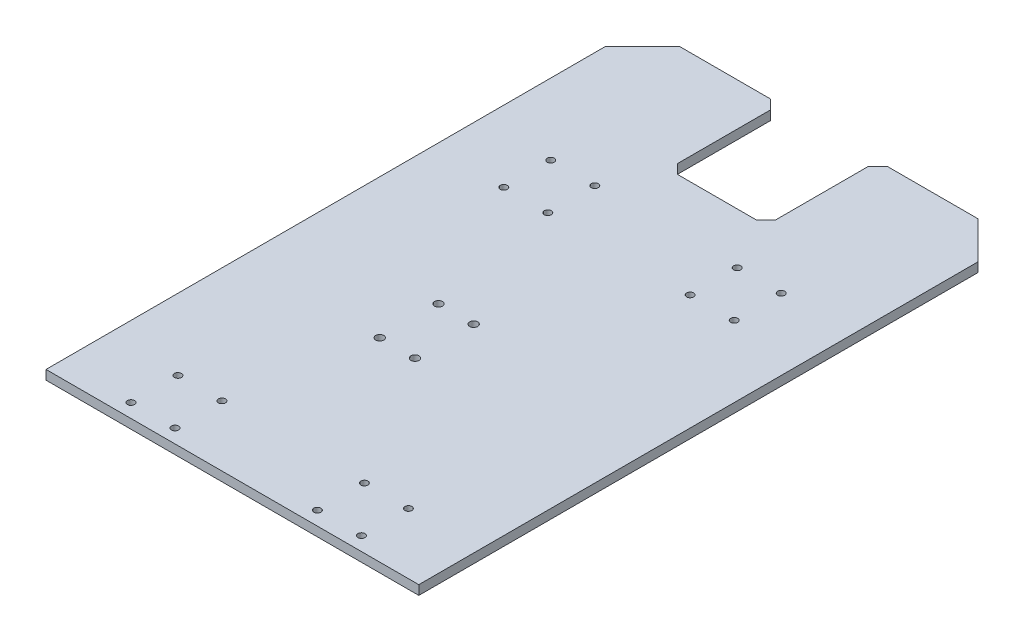
ISO-10303-21;
HEADER;
FILE_DESCRIPTION(('STEP AP214'),'2;1');
FILE_NAME('part.step','',(''),(''),'','','');
FILE_SCHEMA(('AUTOMOTIVE_DESIGN { 1 0 10303 214 1 1 1 1 }'));
ENDSEC;
DATA;
#1=APPLICATION_CONTEXT('core data for automotive mechanical design processes');
#2=APPLICATION_PROTOCOL_DEFINITION('international standard','automotive_design',2000,#1);
#3=PRODUCT_CONTEXT('',#1,'mechanical');
#4=PRODUCT('Part','Part','',(#3));
#5=PRODUCT_RELATED_PRODUCT_CATEGORY('part','',(#4));
#6=PRODUCT_DEFINITION_FORMATION('','',#4);
#7=PRODUCT_DEFINITION_CONTEXT('part definition',#1,'design');
#8=PRODUCT_DEFINITION('design','',#6,#7);
#9=PRODUCT_DEFINITION_SHAPE('','',#8);
#10=(LENGTH_UNIT() NAMED_UNIT(*) SI_UNIT(.MILLI.,.METRE.));
#11=(NAMED_UNIT(*) PLANE_ANGLE_UNIT() SI_UNIT($,.RADIAN.));
#12=(NAMED_UNIT(*) SI_UNIT($,.STERADIAN.) SOLID_ANGLE_UNIT());
#13=UNCERTAINTY_MEASURE_WITH_UNIT(LENGTH_MEASURE(1.E-05),#10,'distance_accuracy_value','');
#14=(GEOMETRIC_REPRESENTATION_CONTEXT(3) GLOBAL_UNCERTAINTY_ASSIGNED_CONTEXT((#13)) GLOBAL_UNIT_ASSIGNED_CONTEXT((#10,
#11,#12)) REPRESENTATION_CONTEXT('',''));
#15=CARTESIAN_POINT('',(0.,0.,0.));
#16=DIRECTION('',(0.,0.,1.));
#17=DIRECTION('',(1.,0.,0.));
#18=AXIS2_PLACEMENT_3D('',#15,#16,#17);
#19=CARTESIAN_POINT('',(0.,0.,-254.));
#20=DIRECTION('',(0.,0.,-1.));
#21=DIRECTION('',(-1.,0.,0.));
#22=AXIS2_PLACEMENT_3D('',#19,#20,#21);
#23=PLANE('',#22);
#24=DIRECTION('',(-1.,0.,0.));
#25=VECTOR('',#24,1.);
#26=CARTESIAN_POINT('',(127.,0.,-254.));
#27=LINE('',#26,#25);
#28=CARTESIAN_POINT('',(101.6,0.,-254.));
#29=VERTEX_POINT('',#28);
#30=CARTESIAN_POINT('',(39.6875,0.,-254.));
#31=VERTEX_POINT('',#30);
#32=EDGE_CURVE('E254',#29,#31,#27,.T.);
#33=ORIENTED_EDGE('',*,*,#32,.T.);
#34=DIRECTION('',(0.,1.,0.));
#35=VECTOR('',#34,1.);
#36=CARTESIAN_POINT('',(39.6875,6.35,-254.));
#37=LINE('',#36,#35);
#38=CARTESIAN_POINT('',(39.6875,6.35,-254.));
#39=VERTEX_POINT('',#38);
#40=EDGE_CURVE('E210',#31,#39,#37,.T.);
#41=ORIENTED_EDGE('',*,*,#40,.T.);
#42=DIRECTION('',(1.,0.,0.));
#43=VECTOR('',#42,1.);
#44=CARTESIAN_POINT('',(-127.,6.35,-254.));
#45=LINE('',#44,#43);
#46=CARTESIAN_POINT('',(101.6,6.35,-254.));
#47=VERTEX_POINT('',#46);
#48=EDGE_CURVE('E265',#39,#47,#45,.T.);
#49=ORIENTED_EDGE('',*,*,#48,.T.);
#50=DIRECTION('',(0.,-1.,0.));
#51=VECTOR('',#50,1.);
#52=CARTESIAN_POINT('',(101.6,0.,-254.));
#53=LINE('',#52,#51);
#54=EDGE_CURVE('E160',#47,#29,#53,.T.);
#55=ORIENTED_EDGE('',*,*,#54,.T.);
#56=EDGE_LOOP('',(#33,#41,#49,#55));
#57=FACE_BOUND('',#56,.T.);
#58=ADVANCED_FACE('F39',(#57),#23,.T.);
#59=CARTESIAN_POINT('',(127.,6.35,-152.4));
#60=DIRECTION('',(-1.,0.,0.));
#61=DIRECTION('',(0.,0.,1.));
#62=AXIS2_PLACEMENT_3D('',#59,#60,#61);
#63=PLANE('',#62);
#64=DIRECTION('',(0.,0.,-1.));
#65=VECTOR('',#64,1.);
#66=CARTESIAN_POINT('',(127.,0.,-152.4));
#67=LINE('',#66,#65);
#68=CARTESIAN_POINT('',(127.,0.,152.4));
#69=VERTEX_POINT('',#68);
#70=CARTESIAN_POINT('',(127.,0.,-228.6));
#71=VERTEX_POINT('',#70);
#72=EDGE_CURVE('E170',#69,#71,#67,.T.);
#73=ORIENTED_EDGE('',*,*,#72,.T.);
#74=DIRECTION('',(0.,1.,0.));
#75=VECTOR('',#74,1.);
#76=CARTESIAN_POINT('',(127.,6.35,-228.6));
#77=LINE('',#76,#75);
#78=CARTESIAN_POINT('',(127.,6.35,-228.6));
#79=VERTEX_POINT('',#78);
#80=EDGE_CURVE('E193',#71,#79,#77,.T.);
#81=ORIENTED_EDGE('',*,*,#80,.T.);
#82=DIRECTION('',(0.,0.,-1.));
#83=VECTOR('',#82,1.);
#84=CARTESIAN_POINT('',(127.,6.35,-152.4));
#85=LINE('',#84,#83);
#86=CARTESIAN_POINT('',(127.,6.35,152.4));
#87=VERTEX_POINT('',#86);
#88=EDGE_CURVE('E151',#87,#79,#85,.T.);
#89=ORIENTED_EDGE('',*,*,#88,.F.);
#90=DIRECTION('',(0.,-1.,0.));
#91=VECTOR('',#90,1.);
#92=CARTESIAN_POINT('',(127.,6.35,152.4));
#93=LINE('',#92,#91);
#94=EDGE_CURVE('E161',#87,#69,#93,.T.);
#95=ORIENTED_EDGE('',*,*,#94,.T.);
#96=EDGE_LOOP('',(#73,#81,#89,#95));
#97=FACE_BOUND('',#96,.T.);
#98=ADVANCED_FACE('F394',(#97),#63,.F.);
#99=CARTESIAN_POINT('',(-127.,6.35,-152.4));
#100=DIRECTION('',(1.,0.,0.));
#101=DIRECTION('',(0.,0.,-1.));
#102=AXIS2_PLACEMENT_3D('',#99,#100,#101);
#103=PLANE('',#102);
#104=DIRECTION('',(0.,0.,1.));
#105=VECTOR('',#104,1.);
#106=CARTESIAN_POINT('',(-127.,6.35,-152.4));
#107=LINE('',#106,#105);
#108=CARTESIAN_POINT('',(-127.,6.35,-228.6));
#109=VERTEX_POINT('',#108);
#110=CARTESIAN_POINT('',(-127.,6.35,152.4));
#111=VERTEX_POINT('',#110);
#112=EDGE_CURVE('E139',#109,#111,#107,.T.);
#113=ORIENTED_EDGE('',*,*,#112,.F.);
#114=DIRECTION('',(0.,-1.,0.));
#115=VECTOR('',#114,1.);
#116=CARTESIAN_POINT('',(-127.,0.,-228.6));
#117=LINE('',#116,#115);
#118=CARTESIAN_POINT('',(-127.,0.,-228.6));
#119=VERTEX_POINT('',#118);
#120=EDGE_CURVE('E186',#109,#119,#117,.T.);
#121=ORIENTED_EDGE('',*,*,#120,.T.);
#122=DIRECTION('',(0.,0.,1.));
#123=VECTOR('',#122,1.);
#124=CARTESIAN_POINT('',(-127.,0.,-152.4));
#125=LINE('',#124,#123);
#126=CARTESIAN_POINT('',(-127.,0.,152.4));
#127=VERTEX_POINT('',#126);
#128=EDGE_CURVE('E157',#119,#127,#125,.T.);
#129=ORIENTED_EDGE('',*,*,#128,.T.);
#130=DIRECTION('',(0.,-1.,0.));
#131=VECTOR('',#130,1.);
#132=CARTESIAN_POINT('',(-127.,6.35,152.4));
#133=LINE('',#132,#131);
#134=EDGE_CURVE('E154',#111,#127,#133,.T.);
#135=ORIENTED_EDGE('',*,*,#134,.F.);
#136=EDGE_LOOP('',(#113,#121,#129,#135));
#137=FACE_BOUND('',#136,.T.);
#138=ADVANCED_FACE('F155',(#137),#103,.F.);
#139=CARTESIAN_POINT('',(-127.,6.35,152.4));
#140=DIRECTION('',(0.,0.,-1.));
#141=DIRECTION('',(-1.,0.,0.));
#142=AXIS2_PLACEMENT_3D('',#139,#140,#141);
#143=PLANE('',#142);
#144=DIRECTION('',(1.,0.,0.));
#145=VECTOR('',#144,1.);
#146=CARTESIAN_POINT('',(-127.,0.,152.4));
#147=LINE('',#146,#145);
#148=EDGE_CURVE('E175',#127,#69,#147,.T.);
#149=ORIENTED_EDGE('',*,*,#148,.T.);
#150=ORIENTED_EDGE('',*,*,#94,.F.);
#151=DIRECTION('',(1.,0.,0.));
#152=VECTOR('',#151,1.);
#153=CARTESIAN_POINT('',(-127.,6.35,152.4));
#154=LINE('',#153,#152);
#155=EDGE_CURVE('E146',#111,#87,#154,.T.);
#156=ORIENTED_EDGE('',*,*,#155,.F.);
#157=ORIENTED_EDGE('',*,*,#134,.T.);
#158=EDGE_LOOP('',(#149,#150,#156,#157));
#159=FACE_BOUND('',#158,.T.);
#160=ADVANCED_FACE('F163',(#159),#143,.F.);
#161=CARTESIAN_POINT('',(0.,6.35,0.));
#162=DIRECTION('',(0.,1.,0.));
#163=DIRECTION('',(0.,0.,1.));
#164=AXIS2_PLACEMENT_3D('',#161,#162,#163);
#165=PLANE('',#164);
#166=CARTESIAN_POINT('',(-8.00000000000002,6.35,-19.9999999739992));
#167=DIRECTION('',(0.,1.,0.));
#168=DIRECTION('',(0.,0.,1.));
#169=AXIS2_PLACEMENT_3D('',#166,#167,#168);
#170=CIRCLE('',#169,2.74999999999999);
#171=CARTESIAN_POINT('',(-8.00000000000002,6.35,-17.2499999739993));
#172=VERTEX_POINT('',#171);
#173=EDGE_CURVE('E728',#172,#172,#170,.T.);
#174=ORIENTED_EDGE('',*,*,#173,.F.);
#175=EDGE_LOOP('',(#174));
#176=FACE_BOUND('',#175,.T.);
#177=CARTESIAN_POINT('',(-32.,6.35,-19.9999999739992));
#178=DIRECTION('',(0.,1.,0.));
#179=DIRECTION('',(0.,0.,1.));
#180=AXIS2_PLACEMENT_3D('',#177,#178,#179);
#181=CIRCLE('',#180,2.74999999999999);
#182=CARTESIAN_POINT('',(-32.,6.35,-17.2499999739993));
#183=VERTEX_POINT('',#182);
#184=EDGE_CURVE('E730',#183,#183,#181,.T.);
#185=ORIENTED_EDGE('',*,*,#184,.F.);
#186=EDGE_LOOP('',(#185));
#187=FACE_BOUND('',#186,.T.);
#188=CARTESIAN_POINT('',(-32.,6.35,20.0000000260008));
#189=DIRECTION('',(0.,1.,0.));
#190=DIRECTION('',(0.,0.,1.));
#191=AXIS2_PLACEMENT_3D('',#188,#189,#190);
#192=CIRCLE('',#191,2.74999999999999);
#193=CARTESIAN_POINT('',(-32.,6.35,22.7500000260008));
#194=VERTEX_POINT('',#193);
#195=EDGE_CURVE('E738',#194,#194,#192,.T.);
#196=ORIENTED_EDGE('',*,*,#195,.F.);
#197=EDGE_LOOP('',(#196));
#198=FACE_BOUND('',#197,.T.);
#199=CARTESIAN_POINT('',(-8.00000000000002,6.35,20.0000000260008));
#200=DIRECTION('',(0.,1.,0.));
#201=DIRECTION('',(0.,0.,1.));
#202=AXIS2_PLACEMENT_3D('',#199,#200,#201);
#203=CIRCLE('',#202,2.74999999999999);
#204=CARTESIAN_POINT('',(-8.00000000000002,6.35,22.7500000260007));
#205=VERTEX_POINT('',#204);
#206=EDGE_CURVE('E744',#205,#205,#203,.T.);
#207=ORIENTED_EDGE('',*,*,#206,.F.);
#208=EDGE_LOOP('',(#207));
#209=FACE_BOUND('',#208,.T.);
#210=ORIENTED_EDGE('',*,*,#48,.F.);
#211=DIRECTION('',(-0.707106781186546,0.,0.707106781186549));
#212=VECTOR('',#211,1.);
#213=CARTESIAN_POINT('',(-107.15625,6.35,-107.156249999999));
#214=LINE('',#213,#212);
#215=CARTESIAN_POINT('',(33.3375,6.35,-247.65));
#216=VERTEX_POINT('',#215);
#217=EDGE_CURVE('E214',#39,#216,#214,.T.);
#218=ORIENTED_EDGE('',*,*,#217,.T.);
#219=DIRECTION('',(0.,0.,-1.));
#220=VECTOR('',#219,1.);
#221=CARTESIAN_POINT('',(33.3375,6.35,-254.));
#222=LINE('',#221,#220);
#223=CARTESIAN_POINT('',(33.3375,6.35,-184.15));
#224=VERTEX_POINT('',#223);
#225=EDGE_CURVE('E237',#224,#216,#222,.T.);
#226=ORIENTED_EDGE('',*,*,#225,.F.);
#227=DIRECTION('',(0.707106781186541,0.,-0.707106781186554));
#228=VECTOR('',#227,1.);
#229=CARTESIAN_POINT('',(33.3375,6.35,-184.15));
#230=LINE('',#229,#228);
#231=CARTESIAN_POINT('',(26.9875,6.35,-177.8));
#232=VERTEX_POINT('',#231);
#233=EDGE_CURVE('E221',#224,#232,#230,.F.);
#234=ORIENTED_EDGE('',*,*,#233,.T.);
#235=DIRECTION('',(1.,0.,0.));
#236=VECTOR('',#235,1.);
#237=CARTESIAN_POINT('',(-33.3375,6.35,-177.8));
#238=LINE('',#237,#236);
#239=CARTESIAN_POINT('',(-26.9874999999999,6.35,-177.8));
#240=VERTEX_POINT('',#239);
#241=EDGE_CURVE('E228',#240,#232,#238,.T.);
#242=ORIENTED_EDGE('',*,*,#241,.F.);
#243=DIRECTION('',(0.707106781186551,0.,0.707106781186544));
#244=VECTOR('',#243,1.);
#245=CARTESIAN_POINT('',(-26.9874999999999,6.35,-177.8));
#246=LINE('',#245,#244);
#247=CARTESIAN_POINT('',(-33.3375,6.35,-184.15));
#248=VERTEX_POINT('',#247);
#249=EDGE_CURVE('E48',#240,#248,#246,.F.);
#250=ORIENTED_EDGE('',*,*,#249,.T.);
#251=DIRECTION('',(0.,0.,1.));
#252=VECTOR('',#251,1.);
#253=CARTESIAN_POINT('',(-33.3375,6.35,-254.));
#254=LINE('',#253,#252);
#255=CARTESIAN_POINT('',(-33.3375,6.35,-247.65));
#256=VERTEX_POINT('',#255);
#257=EDGE_CURVE('E226',#256,#248,#254,.T.);
#258=ORIENTED_EDGE('',*,*,#257,.F.);
#259=DIRECTION('',(-0.707106781186548,0.,-0.707106781186548));
#260=VECTOR('',#259,1.);
#261=CARTESIAN_POINT('',(107.15625,6.35,-107.15625));
#262=LINE('',#261,#260);
#263=CARTESIAN_POINT('',(-39.6875,6.35,-254.));
#264=VERTEX_POINT('',#263);
#265=EDGE_CURVE('E63',#256,#264,#262,.T.);
#266=ORIENTED_EDGE('',*,*,#265,.T.);
#267=CARTESIAN_POINT('',(-101.6,6.35,-254.));
#268=VERTEX_POINT('',#267);
#269=EDGE_CURVE('E266',#268,#264,#45,.T.);
#270=ORIENTED_EDGE('',*,*,#269,.F.);
#271=DIRECTION('',(-0.707106781186546,0.,0.707106781186549));
#272=VECTOR('',#271,1.);
#273=CARTESIAN_POINT('',(-177.8,6.35,-177.8));
#274=LINE('',#273,#272);
#275=EDGE_CURVE('E148',#268,#109,#274,.T.);
#276=ORIENTED_EDGE('',*,*,#275,.T.);
#277=ORIENTED_EDGE('',*,*,#112,.T.);
#278=ORIENTED_EDGE('',*,*,#155,.T.);
#279=ORIENTED_EDGE('',*,*,#88,.T.);
#280=DIRECTION('',(-0.707106781186546,0.,-0.707106781186549));
#281=VECTOR('',#280,1.);
#282=CARTESIAN_POINT('',(177.8,6.35,-177.8));
#283=LINE('',#282,#281);
#284=EDGE_CURVE('E182',#79,#47,#283,.T.);
#285=ORIENTED_EDGE('',*,*,#284,.T.);
#286=EDGE_LOOP('',(#210,#218,#226,#234,#242,#250,#258,#266,#270,#276,#277,#278,#279,#285));
#287=FACE_BOUND('',#286,.T.);
#288=CARTESIAN_POINT('',(78.5000000000001,6.35,111.));
#289=DIRECTION('',(0.,1.,0.));
#290=DIRECTION('',(0.,0.,1.));
#291=AXIS2_PLACEMENT_3D('',#288,#289,#290);
#292=CIRCLE('',#291,2.4);
#293=CARTESIAN_POINT('',(78.5000000000001,6.35,113.4));
#294=VERTEX_POINT('',#293);
#295=EDGE_CURVE('E268',#294,#294,#292,.T.);
#296=ORIENTED_EDGE('',*,*,#295,.F.);
#297=EDGE_LOOP('',(#296));
#298=FACE_BOUND('',#297,.T.);
#299=CARTESIAN_POINT('',(48.5000000000001,6.35,111.));
#300=DIRECTION('',(0.,1.,0.));
#301=DIRECTION('',(0.,0.,1.));
#302=AXIS2_PLACEMENT_3D('',#299,#300,#301);
#303=CIRCLE('',#302,2.4);
#304=CARTESIAN_POINT('',(48.5000000000001,6.35,113.4));
#305=VERTEX_POINT('',#304);
#306=EDGE_CURVE('E274',#305,#305,#303,.T.);
#307=ORIENTED_EDGE('',*,*,#306,.F.);
#308=EDGE_LOOP('',(#307));
#309=FACE_BOUND('',#308,.T.);
#310=CARTESIAN_POINT('',(48.5000000000001,6.35,143.));
#311=DIRECTION('',(0.,1.,0.));
#312=DIRECTION('',(0.,0.,1.));
#313=AXIS2_PLACEMENT_3D('',#310,#311,#312);
#314=CIRCLE('',#313,2.4);
#315=CARTESIAN_POINT('',(48.5000000000001,6.35,145.4));
#316=VERTEX_POINT('',#315);
#317=EDGE_CURVE('E280',#316,#316,#314,.T.);
#318=ORIENTED_EDGE('',*,*,#317,.F.);
#319=EDGE_LOOP('',(#318));
#320=FACE_BOUND('',#319,.T.);
#321=CARTESIAN_POINT('',(78.5000000000001,6.35,143.));
#322=DIRECTION('',(0.,1.,0.));
#323=DIRECTION('',(0.,0.,1.));
#324=AXIS2_PLACEMENT_3D('',#321,#322,#323);
#325=CIRCLE('',#324,2.4);
#326=CARTESIAN_POINT('',(78.5000000000001,6.35,145.4));
#327=VERTEX_POINT('',#326);
#328=EDGE_CURVE('E286',#327,#327,#325,.T.);
#329=ORIENTED_EDGE('',*,*,#328,.F.);
#330=EDGE_LOOP('',(#329));
#331=FACE_BOUND('',#330,.T.);
#332=CARTESIAN_POINT('',(-48.4999999999999,6.35,111.));
#333=DIRECTION('',(0.,1.,0.));
#334=DIRECTION('',(0.,0.,1.));
#335=AXIS2_PLACEMENT_3D('',#332,#333,#334);
#336=CIRCLE('',#335,2.4);
#337=CARTESIAN_POINT('',(-48.4999999999999,6.35,113.4));
#338=VERTEX_POINT('',#337);
#339=EDGE_CURVE('E292',#338,#338,#336,.T.);
#340=ORIENTED_EDGE('',*,*,#339,.F.);
#341=EDGE_LOOP('',(#340));
#342=FACE_BOUND('',#341,.T.);
#343=CARTESIAN_POINT('',(-48.4999999999999,6.35,143.));
#344=DIRECTION('',(0.,1.,0.));
#345=DIRECTION('',(0.,0.,1.));
#346=AXIS2_PLACEMENT_3D('',#343,#344,#345);
#347=CIRCLE('',#346,2.4);
#348=CARTESIAN_POINT('',(-48.4999999999999,6.35,145.4));
#349=VERTEX_POINT('',#348);
#350=EDGE_CURVE('E298',#349,#349,#347,.T.);
#351=ORIENTED_EDGE('',*,*,#350,.F.);
#352=EDGE_LOOP('',(#351));
#353=FACE_BOUND('',#352,.T.);
#354=CARTESIAN_POINT('',(-78.4999999999999,6.35,111.));
#355=DIRECTION('',(0.,1.,0.));
#356=DIRECTION('',(0.,0.,1.));
#357=AXIS2_PLACEMENT_3D('',#354,#355,#356);
#358=CIRCLE('',#357,2.4);
#359=CARTESIAN_POINT('',(-78.4999999999999,6.35,113.4));
#360=VERTEX_POINT('',#359);
#361=EDGE_CURVE('E304',#360,#360,#358,.T.);
#362=ORIENTED_EDGE('',*,*,#361,.F.);
#363=EDGE_LOOP('',(#362));
#364=FACE_BOUND('',#363,.T.);
#365=CARTESIAN_POINT('',(-78.4999999999999,6.35,143.));
#366=DIRECTION('',(0.,1.,0.));
#367=DIRECTION('',(0.,0.,1.));
#368=AXIS2_PLACEMENT_3D('',#365,#366,#367);
#369=CIRCLE('',#368,2.4);
#370=CARTESIAN_POINT('',(-78.4999999999999,6.35,145.4));
#371=VERTEX_POINT('',#370);
#372=EDGE_CURVE('E310',#371,#371,#369,.T.);
#373=ORIENTED_EDGE('',*,*,#372,.F.);
#374=EDGE_LOOP('',(#373));
#375=FACE_BOUND('',#374,.T.);
#376=CARTESIAN_POINT('',(78.5,6.35,-143.));
#377=DIRECTION('',(0.,1.,0.));
#378=DIRECTION('',(0.,0.,1.));
#379=AXIS2_PLACEMENT_3D('',#376,#377,#378);
#380=CIRCLE('',#379,2.4);
#381=CARTESIAN_POINT('',(78.5,6.35,-140.6));
#382=VERTEX_POINT('',#381);
#383=EDGE_CURVE('E316',#382,#382,#380,.T.);
#384=ORIENTED_EDGE('',*,*,#383,.F.);
#385=EDGE_LOOP('',(#384));
#386=FACE_BOUND('',#385,.T.);
#387=CARTESIAN_POINT('',(78.5,6.35,-111.));
#388=DIRECTION('',(0.,1.,0.));
#389=DIRECTION('',(0.,0.,1.));
#390=AXIS2_PLACEMENT_3D('',#387,#388,#389);
#391=CIRCLE('',#390,2.4);
#392=CARTESIAN_POINT('',(78.5,6.35,-108.6));
#393=VERTEX_POINT('',#392);
#394=EDGE_CURVE('E322',#393,#393,#391,.T.);
#395=ORIENTED_EDGE('',*,*,#394,.F.);
#396=EDGE_LOOP('',(#395));
#397=FACE_BOUND('',#396,.T.);
#398=CARTESIAN_POINT('',(48.5,6.35,-143.));
#399=DIRECTION('',(0.,1.,0.));
#400=DIRECTION('',(0.,0.,1.));
#401=AXIS2_PLACEMENT_3D('',#398,#399,#400);
#402=CIRCLE('',#401,2.4);
#403=CARTESIAN_POINT('',(48.5,6.35,-140.6));
#404=VERTEX_POINT('',#403);
#405=EDGE_CURVE('E328',#404,#404,#402,.T.);
#406=ORIENTED_EDGE('',*,*,#405,.F.);
#407=EDGE_LOOP('',(#406));
#408=FACE_BOUND('',#407,.T.);
#409=CARTESIAN_POINT('',(48.5,6.35,-111.));
#410=DIRECTION('',(0.,1.,0.));
#411=DIRECTION('',(0.,0.,1.));
#412=AXIS2_PLACEMENT_3D('',#409,#410,#411);
#413=CIRCLE('',#412,2.4);
#414=CARTESIAN_POINT('',(48.5,6.35,-108.6));
#415=VERTEX_POINT('',#414);
#416=EDGE_CURVE('E334',#415,#415,#413,.T.);
#417=ORIENTED_EDGE('',*,*,#416,.F.);
#418=EDGE_LOOP('',(#417));
#419=FACE_BOUND('',#418,.T.);
#420=CARTESIAN_POINT('',(-48.5,6.35,-143.));
#421=DIRECTION('',(0.,1.,0.));
#422=DIRECTION('',(0.,0.,1.));
#423=AXIS2_PLACEMENT_3D('',#420,#421,#422);
#424=CIRCLE('',#423,2.4);
#425=CARTESIAN_POINT('',(-48.5,6.35,-140.6));
#426=VERTEX_POINT('',#425);
#427=EDGE_CURVE('E340',#426,#426,#424,.T.);
#428=ORIENTED_EDGE('',*,*,#427,.F.);
#429=EDGE_LOOP('',(#428));
#430=FACE_BOUND('',#429,.T.);
#431=CARTESIAN_POINT('',(-48.4999999999999,6.35,-111.));
#432=DIRECTION('',(0.,1.,0.));
#433=DIRECTION('',(0.,0.,1.));
#434=AXIS2_PLACEMENT_3D('',#431,#432,#433);
#435=CIRCLE('',#434,2.4);
#436=CARTESIAN_POINT('',(-48.4999999999999,6.35,-108.6));
#437=VERTEX_POINT('',#436);
#438=EDGE_CURVE('E346',#437,#437,#435,.T.);
#439=ORIENTED_EDGE('',*,*,#438,.F.);
#440=EDGE_LOOP('',(#439));
#441=FACE_BOUND('',#440,.T.);
#442=CARTESIAN_POINT('',(-78.4999999999999,6.35,-143.));
#443=DIRECTION('',(0.,1.,0.));
#444=DIRECTION('',(0.,0.,1.));
#445=AXIS2_PLACEMENT_3D('',#442,#443,#444);
#446=CIRCLE('',#445,2.4);
#447=CARTESIAN_POINT('',(-78.4999999999999,6.35,-140.6));
#448=VERTEX_POINT('',#447);
#449=EDGE_CURVE('E352',#448,#448,#446,.T.);
#450=ORIENTED_EDGE('',*,*,#449,.F.);
#451=EDGE_LOOP('',(#450));
#452=FACE_BOUND('',#451,.T.);
#453=CARTESIAN_POINT('',(-78.4999999999999,6.35,-111.));
#454=DIRECTION('',(0.,1.,0.));
#455=DIRECTION('',(0.,0.,1.));
#456=AXIS2_PLACEMENT_3D('',#453,#454,#455);
#457=CIRCLE('',#456,2.4);
#458=CARTESIAN_POINT('',(-78.4999999999999,6.35,-108.6));
#459=VERTEX_POINT('',#458);
#460=EDGE_CURVE('E358',#459,#459,#457,.T.);
#461=ORIENTED_EDGE('',*,*,#460,.F.);
#462=EDGE_LOOP('',(#461));
#463=FACE_BOUND('',#462,.T.);
#464=ADVANCED_FACE('F142',(#176,#187,#198,#209,#287,#298,#309,#320,#331,#342,#353,#364,#375,
#386,#397,#408,#419,#430,#441,#452,#463),#165,.T.);
#465=CARTESIAN_POINT('',(0.,0.,0.));
#466=DIRECTION('',(0.,1.,0.));
#467=DIRECTION('',(0.,0.,1.));
#468=AXIS2_PLACEMENT_3D('',#465,#466,#467);
#469=PLANE('',#468);
#470=CARTESIAN_POINT('',(-8.00000000000002,0.,-19.9999999739992));
#471=DIRECTION('',(0.,1.,0.));
#472=DIRECTION('',(0.,0.,1.));
#473=AXIS2_PLACEMENT_3D('',#470,#471,#472);
#474=CIRCLE('',#473,2.74999999999999);
#475=CARTESIAN_POINT('',(-8.00000000000002,0.,-17.2499999739993));
#476=VERTEX_POINT('',#475);
#477=EDGE_CURVE('E725',#476,#476,#474,.T.);
#478=ORIENTED_EDGE('',*,*,#477,.T.);
#479=EDGE_LOOP('',(#478));
#480=FACE_BOUND('',#479,.T.);
#481=CARTESIAN_POINT('',(-32.,0.,-19.9999999739992));
#482=DIRECTION('',(0.,1.,0.));
#483=DIRECTION('',(0.,0.,1.));
#484=AXIS2_PLACEMENT_3D('',#481,#482,#483);
#485=CIRCLE('',#484,2.74999999999999);
#486=CARTESIAN_POINT('',(-32.,0.,-17.2499999739993));
#487=VERTEX_POINT('',#486);
#488=EDGE_CURVE('E735',#487,#487,#485,.T.);
#489=ORIENTED_EDGE('',*,*,#488,.T.);
#490=EDGE_LOOP('',(#489));
#491=FACE_BOUND('',#490,.T.);
#492=CARTESIAN_POINT('',(-32.,0.,20.0000000260008));
#493=DIRECTION('',(0.,1.,0.));
#494=DIRECTION('',(0.,0.,1.));
#495=AXIS2_PLACEMENT_3D('',#492,#493,#494);
#496=CIRCLE('',#495,2.74999999999999);
#497=CARTESIAN_POINT('',(-32.,0.,22.7500000260008));
#498=VERTEX_POINT('',#497);
#499=EDGE_CURVE('E741',#498,#498,#496,.T.);
#500=ORIENTED_EDGE('',*,*,#499,.T.);
#501=EDGE_LOOP('',(#500));
#502=FACE_BOUND('',#501,.T.);
#503=CARTESIAN_POINT('',(-8.00000000000002,0.,20.0000000260008));
#504=DIRECTION('',(0.,1.,0.));
#505=DIRECTION('',(0.,0.,1.));
#506=AXIS2_PLACEMENT_3D('',#503,#504,#505);
#507=CIRCLE('',#506,2.74999999999999);
#508=CARTESIAN_POINT('',(-8.00000000000002,0.,22.7500000260007));
#509=VERTEX_POINT('',#508);
#510=EDGE_CURVE('E261',#509,#509,#507,.T.);
#511=ORIENTED_EDGE('',*,*,#510,.T.);
#512=EDGE_LOOP('',(#511));
#513=FACE_BOUND('',#512,.T.);
#514=CARTESIAN_POINT('',(78.5000000000001,0.,111.));
#515=DIRECTION('',(0.,1.,0.));
#516=DIRECTION('',(0.,0.,1.));
#517=AXIS2_PLACEMENT_3D('',#514,#515,#516);
#518=CIRCLE('',#517,2.4);
#519=CARTESIAN_POINT('',(78.5000000000001,0.,113.4));
#520=VERTEX_POINT('',#519);
#521=EDGE_CURVE('E271',#520,#520,#518,.T.);
#522=ORIENTED_EDGE('',*,*,#521,.T.);
#523=EDGE_LOOP('',(#522));
#524=FACE_BOUND('',#523,.T.);
#525=CARTESIAN_POINT('',(48.5000000000001,0.,111.));
#526=DIRECTION('',(0.,1.,0.));
#527=DIRECTION('',(0.,0.,1.));
#528=AXIS2_PLACEMENT_3D('',#525,#526,#527);
#529=CIRCLE('',#528,2.4);
#530=CARTESIAN_POINT('',(48.5000000000001,0.,113.4));
#531=VERTEX_POINT('',#530);
#532=EDGE_CURVE('E277',#531,#531,#529,.T.);
#533=ORIENTED_EDGE('',*,*,#532,.T.);
#534=EDGE_LOOP('',(#533));
#535=FACE_BOUND('',#534,.T.);
#536=CARTESIAN_POINT('',(48.5000000000001,0.,143.));
#537=DIRECTION('',(0.,1.,0.));
#538=DIRECTION('',(0.,0.,1.));
#539=AXIS2_PLACEMENT_3D('',#536,#537,#538);
#540=CIRCLE('',#539,2.4);
#541=CARTESIAN_POINT('',(48.5000000000001,0.,145.4));
#542=VERTEX_POINT('',#541);
#543=EDGE_CURVE('E283',#542,#542,#540,.T.);
#544=ORIENTED_EDGE('',*,*,#543,.T.);
#545=EDGE_LOOP('',(#544));
#546=FACE_BOUND('',#545,.T.);
#547=CARTESIAN_POINT('',(78.5000000000001,0.,143.));
#548=DIRECTION('',(0.,1.,0.));
#549=DIRECTION('',(0.,0.,1.));
#550=AXIS2_PLACEMENT_3D('',#547,#548,#549);
#551=CIRCLE('',#550,2.4);
#552=CARTESIAN_POINT('',(78.5000000000001,0.,145.4));
#553=VERTEX_POINT('',#552);
#554=EDGE_CURVE('E289',#553,#553,#551,.T.);
#555=ORIENTED_EDGE('',*,*,#554,.T.);
#556=EDGE_LOOP('',(#555));
#557=FACE_BOUND('',#556,.T.);
#558=CARTESIAN_POINT('',(-48.4999999999999,0.,111.));
#559=DIRECTION('',(0.,1.,0.));
#560=DIRECTION('',(0.,0.,1.));
#561=AXIS2_PLACEMENT_3D('',#558,#559,#560);
#562=CIRCLE('',#561,2.4);
#563=CARTESIAN_POINT('',(-48.4999999999999,0.,113.4));
#564=VERTEX_POINT('',#563);
#565=EDGE_CURVE('E295',#564,#564,#562,.T.);
#566=ORIENTED_EDGE('',*,*,#565,.T.);
#567=EDGE_LOOP('',(#566));
#568=FACE_BOUND('',#567,.T.);
#569=CARTESIAN_POINT('',(-48.4999999999999,0.,143.));
#570=DIRECTION('',(0.,1.,0.));
#571=DIRECTION('',(0.,0.,1.));
#572=AXIS2_PLACEMENT_3D('',#569,#570,#571);
#573=CIRCLE('',#572,2.4);
#574=CARTESIAN_POINT('',(-48.4999999999999,0.,145.4));
#575=VERTEX_POINT('',#574);
#576=EDGE_CURVE('E301',#575,#575,#573,.T.);
#577=ORIENTED_EDGE('',*,*,#576,.T.);
#578=EDGE_LOOP('',(#577));
#579=FACE_BOUND('',#578,.T.);
#580=CARTESIAN_POINT('',(-78.4999999999999,0.,111.));
#581=DIRECTION('',(0.,1.,0.));
#582=DIRECTION('',(0.,0.,1.));
#583=AXIS2_PLACEMENT_3D('',#580,#581,#582);
#584=CIRCLE('',#583,2.4);
#585=CARTESIAN_POINT('',(-78.4999999999999,0.,113.4));
#586=VERTEX_POINT('',#585);
#587=EDGE_CURVE('E307',#586,#586,#584,.T.);
#588=ORIENTED_EDGE('',*,*,#587,.T.);
#589=EDGE_LOOP('',(#588));
#590=FACE_BOUND('',#589,.T.);
#591=CARTESIAN_POINT('',(-78.4999999999999,0.,143.));
#592=DIRECTION('',(0.,1.,0.));
#593=DIRECTION('',(0.,0.,1.));
#594=AXIS2_PLACEMENT_3D('',#591,#592,#593);
#595=CIRCLE('',#594,2.4);
#596=CARTESIAN_POINT('',(-78.4999999999999,0.,145.4));
#597=VERTEX_POINT('',#596);
#598=EDGE_CURVE('E313',#597,#597,#595,.T.);
#599=ORIENTED_EDGE('',*,*,#598,.T.);
#600=EDGE_LOOP('',(#599));
#601=FACE_BOUND('',#600,.T.);
#602=CARTESIAN_POINT('',(78.5,0.,-143.));
#603=DIRECTION('',(0.,1.,0.));
#604=DIRECTION('',(0.,0.,1.));
#605=AXIS2_PLACEMENT_3D('',#602,#603,#604);
#606=CIRCLE('',#605,2.4);
#607=CARTESIAN_POINT('',(78.5,0.,-140.6));
#608=VERTEX_POINT('',#607);
#609=EDGE_CURVE('E319',#608,#608,#606,.T.);
#610=ORIENTED_EDGE('',*,*,#609,.T.);
#611=EDGE_LOOP('',(#610));
#612=FACE_BOUND('',#611,.T.);
#613=CARTESIAN_POINT('',(78.5,0.,-111.));
#614=DIRECTION('',(0.,1.,0.));
#615=DIRECTION('',(0.,0.,1.));
#616=AXIS2_PLACEMENT_3D('',#613,#614,#615);
#617=CIRCLE('',#616,2.4);
#618=CARTESIAN_POINT('',(78.5,0.,-108.6));
#619=VERTEX_POINT('',#618);
#620=EDGE_CURVE('E325',#619,#619,#617,.T.);
#621=ORIENTED_EDGE('',*,*,#620,.T.);
#622=EDGE_LOOP('',(#621));
#623=FACE_BOUND('',#622,.T.);
#624=CARTESIAN_POINT('',(48.5,0.,-143.));
#625=DIRECTION('',(0.,1.,0.));
#626=DIRECTION('',(0.,0.,1.));
#627=AXIS2_PLACEMENT_3D('',#624,#625,#626);
#628=CIRCLE('',#627,2.4);
#629=CARTESIAN_POINT('',(48.5,0.,-140.6));
#630=VERTEX_POINT('',#629);
#631=EDGE_CURVE('E331',#630,#630,#628,.T.);
#632=ORIENTED_EDGE('',*,*,#631,.T.);
#633=EDGE_LOOP('',(#632));
#634=FACE_BOUND('',#633,.T.);
#635=CARTESIAN_POINT('',(48.5,0.,-111.));
#636=DIRECTION('',(0.,1.,0.));
#637=DIRECTION('',(0.,0.,1.));
#638=AXIS2_PLACEMENT_3D('',#635,#636,#637);
#639=CIRCLE('',#638,2.4);
#640=CARTESIAN_POINT('',(48.5,0.,-108.6));
#641=VERTEX_POINT('',#640);
#642=EDGE_CURVE('E337',#641,#641,#639,.T.);
#643=ORIENTED_EDGE('',*,*,#642,.T.);
#644=EDGE_LOOP('',(#643));
#645=FACE_BOUND('',#644,.T.);
#646=CARTESIAN_POINT('',(-48.5,0.,-143.));
#647=DIRECTION('',(0.,1.,0.));
#648=DIRECTION('',(0.,0.,1.));
#649=AXIS2_PLACEMENT_3D('',#646,#647,#648);
#650=CIRCLE('',#649,2.4);
#651=CARTESIAN_POINT('',(-48.5,0.,-140.6));
#652=VERTEX_POINT('',#651);
#653=EDGE_CURVE('E343',#652,#652,#650,.T.);
#654=ORIENTED_EDGE('',*,*,#653,.T.);
#655=EDGE_LOOP('',(#654));
#656=FACE_BOUND('',#655,.T.);
#657=CARTESIAN_POINT('',(-48.4999999999999,0.,-111.));
#658=DIRECTION('',(0.,1.,0.));
#659=DIRECTION('',(0.,0.,1.));
#660=AXIS2_PLACEMENT_3D('',#657,#658,#659);
#661=CIRCLE('',#660,2.4);
#662=CARTESIAN_POINT('',(-48.4999999999999,0.,-108.6));
#663=VERTEX_POINT('',#662);
#664=EDGE_CURVE('E349',#663,#663,#661,.T.);
#665=ORIENTED_EDGE('',*,*,#664,.T.);
#666=EDGE_LOOP('',(#665));
#667=FACE_BOUND('',#666,.T.);
#668=CARTESIAN_POINT('',(-78.4999999999999,0.,-143.));
#669=DIRECTION('',(0.,1.,0.));
#670=DIRECTION('',(0.,0.,1.));
#671=AXIS2_PLACEMENT_3D('',#668,#669,#670);
#672=CIRCLE('',#671,2.4);
#673=CARTESIAN_POINT('',(-78.4999999999999,0.,-140.6));
#674=VERTEX_POINT('',#673);
#675=EDGE_CURVE('E355',#674,#674,#672,.T.);
#676=ORIENTED_EDGE('',*,*,#675,.T.);
#677=EDGE_LOOP('',(#676));
#678=FACE_BOUND('',#677,.T.);
#679=CARTESIAN_POINT('',(-78.4999999999999,0.,-111.));
#680=DIRECTION('',(0.,1.,0.));
#681=DIRECTION('',(0.,0.,1.));
#682=AXIS2_PLACEMENT_3D('',#679,#680,#681);
#683=CIRCLE('',#682,2.4);
#684=CARTESIAN_POINT('',(-78.4999999999999,0.,-108.6));
#685=VERTEX_POINT('',#684);
#686=EDGE_CURVE('E173',#685,#685,#683,.T.);
#687=ORIENTED_EDGE('',*,*,#686,.T.);
#688=EDGE_LOOP('',(#687));
#689=FACE_BOUND('',#688,.T.);
#690=DIRECTION('',(0.,0.,-1.));
#691=VECTOR('',#690,1.);
#692=CARTESIAN_POINT('',(33.3375,0.,-254.));
#693=LINE('',#692,#691);
#694=CARTESIAN_POINT('',(33.3375,0.,-184.15));
#695=VERTEX_POINT('',#694);
#696=CARTESIAN_POINT('',(33.3375,0.,-247.65));
#697=VERTEX_POINT('',#696);
#698=EDGE_CURVE('E256',#695,#697,#693,.T.);
#699=ORIENTED_EDGE('',*,*,#698,.T.);
#700=DIRECTION('',(0.707106781186546,0.,-0.707106781186549));
#701=VECTOR('',#700,1.);
#702=CARTESIAN_POINT('',(39.6875,0.,-254.));
#703=LINE('',#702,#701);
#704=EDGE_CURVE('E218',#697,#31,#703,.T.);
#705=ORIENTED_EDGE('',*,*,#704,.T.);
#706=ORIENTED_EDGE('',*,*,#32,.F.);
#707=DIRECTION('',(0.707106781186546,0.,0.707106781186549));
#708=VECTOR('',#707,1.);
#709=CARTESIAN_POINT('',(101.6,0.,-254.));
#710=LINE('',#709,#708);
#711=EDGE_CURVE('E188',#29,#71,#710,.T.);
#712=ORIENTED_EDGE('',*,*,#711,.T.);
#713=ORIENTED_EDGE('',*,*,#72,.F.);
#714=ORIENTED_EDGE('',*,*,#148,.F.);
#715=ORIENTED_EDGE('',*,*,#128,.F.);
#716=DIRECTION('',(0.707106781186546,0.,-0.707106781186549));
#717=VECTOR('',#716,1.);
#718=CARTESIAN_POINT('',(-101.6,0.,-254.));
#719=LINE('',#718,#717);
#720=CARTESIAN_POINT('',(-101.6,0.,-254.));
#721=VERTEX_POINT('',#720);
#722=EDGE_CURVE('E190',#119,#721,#719,.T.);
#723=ORIENTED_EDGE('',*,*,#722,.T.);
#724=CARTESIAN_POINT('',(-39.6875,0.,-254.));
#725=VERTEX_POINT('',#724);
#726=EDGE_CURVE('E252',#725,#721,#27,.T.);
#727=ORIENTED_EDGE('',*,*,#726,.F.);
#728=DIRECTION('',(0.707106781186548,0.,0.707106781186548));
#729=VECTOR('',#728,1.);
#730=CARTESIAN_POINT('',(-33.3375,0.,-247.65));
#731=LINE('',#730,#729);
#732=CARTESIAN_POINT('',(-33.3375,0.,-247.65));
#733=VERTEX_POINT('',#732);
#734=EDGE_CURVE('E216',#725,#733,#731,.T.);
#735=ORIENTED_EDGE('',*,*,#734,.T.);
#736=DIRECTION('',(0.,0.,1.));
#737=VECTOR('',#736,1.);
#738=CARTESIAN_POINT('',(-33.3375,0.,-254.));
#739=LINE('',#738,#737);
#740=CARTESIAN_POINT('',(-33.3375,0.,-184.15));
#741=VERTEX_POINT('',#740);
#742=EDGE_CURVE('E248',#733,#741,#739,.T.);
#743=ORIENTED_EDGE('',*,*,#742,.T.);
#744=DIRECTION('',(-0.707106781186551,0.,-0.707106781186544));
#745=VECTOR('',#744,1.);
#746=CARTESIAN_POINT('',(75.4062500000002,0.,-75.4062500000008));
#747=LINE('',#746,#745);
#748=CARTESIAN_POINT('',(-26.9874999999999,0.,-177.8));
#749=VERTEX_POINT('',#748);
#750=EDGE_CURVE('E11',#741,#749,#747,.F.);
#751=ORIENTED_EDGE('',*,*,#750,.T.);
#752=DIRECTION('',(1.,0.,0.));
#753=VECTOR('',#752,1.);
#754=CARTESIAN_POINT('',(-33.3375,0.,-177.8));
#755=LINE('',#754,#753);
#756=CARTESIAN_POINT('',(26.9875,0.,-177.8));
#757=VERTEX_POINT('',#756);
#758=EDGE_CURVE('E246',#749,#757,#755,.T.);
#759=ORIENTED_EDGE('',*,*,#758,.T.);
#760=DIRECTION('',(-0.707106781186541,0.,0.707106781186554));
#761=VECTOR('',#760,1.);
#762=CARTESIAN_POINT('',(-75.4062499999997,0.,-75.4062499999984));
#763=LINE('',#762,#761);
#764=EDGE_CURVE('E223',#757,#695,#763,.F.);
#765=ORIENTED_EDGE('',*,*,#764,.T.);
#766=EDGE_LOOP('',(#699,#705,#706,#712,#713,#714,#715,#723,#727,#735,#743,#751,#759,#765));
#767=FACE_BOUND('',#766,.T.);
#768=ADVANCED_FACE('F245',(#480,#491,#502,#513,#524,#535,#546,#557,#568,#579,#590,#601,#612,
#623,#634,#645,#656,#667,#678,#689,#767),#469,.F.);
#769=CARTESIAN_POINT('',(-78.4999999999999,6.35,-111.));
#770=DIRECTION('',(0.,1.,0.));
#771=DIRECTION('',(0.,0.,1.));
#772=AXIS2_PLACEMENT_3D('',#769,#770,#771);
#773=CYLINDRICAL_SURFACE('',#772,2.4);
#774=ORIENTED_EDGE('',*,*,#686,.F.);
#775=EDGE_LOOP('',(#774));
#776=FACE_BOUND('',#775,.T.);
#777=ORIENTED_EDGE('',*,*,#460,.T.);
#778=EDGE_LOOP('',(#777));
#779=FACE_BOUND('',#778,.T.);
#780=ADVANCED_FACE('F450',(#776,#779),#773,.F.);
#781=CARTESIAN_POINT('',(-78.4999999999999,6.35,-143.));
#782=DIRECTION('',(0.,1.,0.));
#783=DIRECTION('',(0.,0.,1.));
#784=AXIS2_PLACEMENT_3D('',#781,#782,#783);
#785=CYLINDRICAL_SURFACE('',#784,2.4);
#786=ORIENTED_EDGE('',*,*,#675,.F.);
#787=EDGE_LOOP('',(#786));
#788=FACE_BOUND('',#787,.T.);
#789=ORIENTED_EDGE('',*,*,#449,.T.);
#790=EDGE_LOOP('',(#789));
#791=FACE_BOUND('',#790,.T.);
#792=ADVANCED_FACE('F457',(#788,#791),#785,.F.);
#793=CARTESIAN_POINT('',(-48.4999999999999,6.35,-111.));
#794=DIRECTION('',(0.,1.,0.));
#795=DIRECTION('',(0.,0.,1.));
#796=AXIS2_PLACEMENT_3D('',#793,#794,#795);
#797=CYLINDRICAL_SURFACE('',#796,2.4);
#798=ORIENTED_EDGE('',*,*,#664,.F.);
#799=EDGE_LOOP('',(#798));
#800=FACE_BOUND('',#799,.T.);
#801=ORIENTED_EDGE('',*,*,#438,.T.);
#802=EDGE_LOOP('',(#801));
#803=FACE_BOUND('',#802,.T.);
#804=ADVANCED_FACE('F461',(#800,#803),#797,.F.);
#805=CARTESIAN_POINT('',(-48.5,6.35,-143.));
#806=DIRECTION('',(0.,1.,0.));
#807=DIRECTION('',(0.,0.,1.));
#808=AXIS2_PLACEMENT_3D('',#805,#806,#807);
#809=CYLINDRICAL_SURFACE('',#808,2.4);
#810=ORIENTED_EDGE('',*,*,#653,.F.);
#811=EDGE_LOOP('',(#810));
#812=FACE_BOUND('',#811,.T.);
#813=ORIENTED_EDGE('',*,*,#427,.T.);
#814=EDGE_LOOP('',(#813));
#815=FACE_BOUND('',#814,.T.);
#816=ADVANCED_FACE('F465',(#812,#815),#809,.F.);
#817=CARTESIAN_POINT('',(48.5,6.35,-111.));
#818=DIRECTION('',(0.,1.,0.));
#819=DIRECTION('',(0.,0.,1.));
#820=AXIS2_PLACEMENT_3D('',#817,#818,#819);
#821=CYLINDRICAL_SURFACE('',#820,2.4);
#822=ORIENTED_EDGE('',*,*,#642,.F.);
#823=EDGE_LOOP('',(#822));
#824=FACE_BOUND('',#823,.T.);
#825=ORIENTED_EDGE('',*,*,#416,.T.);
#826=EDGE_LOOP('',(#825));
#827=FACE_BOUND('',#826,.T.);
#828=ADVANCED_FACE('F469',(#824,#827),#821,.F.);
#829=CARTESIAN_POINT('',(48.5,6.35,-143.));
#830=DIRECTION('',(0.,1.,0.));
#831=DIRECTION('',(0.,0.,1.));
#832=AXIS2_PLACEMENT_3D('',#829,#830,#831);
#833=CYLINDRICAL_SURFACE('',#832,2.4);
#834=ORIENTED_EDGE('',*,*,#631,.F.);
#835=EDGE_LOOP('',(#834));
#836=FACE_BOUND('',#835,.T.);
#837=ORIENTED_EDGE('',*,*,#405,.T.);
#838=EDGE_LOOP('',(#837));
#839=FACE_BOUND('',#838,.T.);
#840=ADVANCED_FACE('F473',(#836,#839),#833,.F.);
#841=CARTESIAN_POINT('',(78.5,6.35,-111.));
#842=DIRECTION('',(0.,1.,0.));
#843=DIRECTION('',(0.,0.,1.));
#844=AXIS2_PLACEMENT_3D('',#841,#842,#843);
#845=CYLINDRICAL_SURFACE('',#844,2.4);
#846=ORIENTED_EDGE('',*,*,#620,.F.);
#847=EDGE_LOOP('',(#846));
#848=FACE_BOUND('',#847,.T.);
#849=ORIENTED_EDGE('',*,*,#394,.T.);
#850=EDGE_LOOP('',(#849));
#851=FACE_BOUND('',#850,.T.);
#852=ADVANCED_FACE('F477',(#848,#851),#845,.F.);
#853=CARTESIAN_POINT('',(78.5,6.35,-143.));
#854=DIRECTION('',(0.,1.,0.));
#855=DIRECTION('',(0.,0.,1.));
#856=AXIS2_PLACEMENT_3D('',#853,#854,#855);
#857=CYLINDRICAL_SURFACE('',#856,2.4);
#858=ORIENTED_EDGE('',*,*,#609,.F.);
#859=EDGE_LOOP('',(#858));
#860=FACE_BOUND('',#859,.T.);
#861=ORIENTED_EDGE('',*,*,#383,.T.);
#862=EDGE_LOOP('',(#861));
#863=FACE_BOUND('',#862,.T.);
#864=ADVANCED_FACE('F481',(#860,#863),#857,.F.);
#865=CARTESIAN_POINT('',(-78.4999999999999,6.35,143.));
#866=DIRECTION('',(0.,1.,0.));
#867=DIRECTION('',(0.,0.,1.));
#868=AXIS2_PLACEMENT_3D('',#865,#866,#867);
#869=CYLINDRICAL_SURFACE('',#868,2.4);
#870=ORIENTED_EDGE('',*,*,#598,.F.);
#871=EDGE_LOOP('',(#870));
#872=FACE_BOUND('',#871,.T.);
#873=ORIENTED_EDGE('',*,*,#372,.T.);
#874=EDGE_LOOP('',(#873));
#875=FACE_BOUND('',#874,.T.);
#876=ADVANCED_FACE('F485',(#872,#875),#869,.F.);
#877=CARTESIAN_POINT('',(-78.4999999999999,6.35,111.));
#878=DIRECTION('',(0.,1.,0.));
#879=DIRECTION('',(0.,0.,1.));
#880=AXIS2_PLACEMENT_3D('',#877,#878,#879);
#881=CYLINDRICAL_SURFACE('',#880,2.4);
#882=ORIENTED_EDGE('',*,*,#587,.F.);
#883=EDGE_LOOP('',(#882));
#884=FACE_BOUND('',#883,.T.);
#885=ORIENTED_EDGE('',*,*,#361,.T.);
#886=EDGE_LOOP('',(#885));
#887=FACE_BOUND('',#886,.T.);
#888=ADVANCED_FACE('F489',(#884,#887),#881,.F.);
#889=CARTESIAN_POINT('',(-48.4999999999999,6.35,143.));
#890=DIRECTION('',(0.,1.,0.));
#891=DIRECTION('',(0.,0.,1.));
#892=AXIS2_PLACEMENT_3D('',#889,#890,#891);
#893=CYLINDRICAL_SURFACE('',#892,2.4);
#894=ORIENTED_EDGE('',*,*,#576,.F.);
#895=EDGE_LOOP('',(#894));
#896=FACE_BOUND('',#895,.T.);
#897=ORIENTED_EDGE('',*,*,#350,.T.);
#898=EDGE_LOOP('',(#897));
#899=FACE_BOUND('',#898,.T.);
#900=ADVANCED_FACE('F493',(#896,#899),#893,.F.);
#901=CARTESIAN_POINT('',(-48.4999999999999,6.35,111.));
#902=DIRECTION('',(0.,1.,0.));
#903=DIRECTION('',(0.,0.,1.));
#904=AXIS2_PLACEMENT_3D('',#901,#902,#903);
#905=CYLINDRICAL_SURFACE('',#904,2.4);
#906=ORIENTED_EDGE('',*,*,#565,.F.);
#907=EDGE_LOOP('',(#906));
#908=FACE_BOUND('',#907,.T.);
#909=ORIENTED_EDGE('',*,*,#339,.T.);
#910=EDGE_LOOP('',(#909));
#911=FACE_BOUND('',#910,.T.);
#912=ADVANCED_FACE('F497',(#908,#911),#905,.F.);
#913=CARTESIAN_POINT('',(78.5000000000001,6.35,143.));
#914=DIRECTION('',(0.,1.,0.));
#915=DIRECTION('',(0.,0.,1.));
#916=AXIS2_PLACEMENT_3D('',#913,#914,#915);
#917=CYLINDRICAL_SURFACE('',#916,2.4);
#918=ORIENTED_EDGE('',*,*,#554,.F.);
#919=EDGE_LOOP('',(#918));
#920=FACE_BOUND('',#919,.T.);
#921=ORIENTED_EDGE('',*,*,#328,.T.);
#922=EDGE_LOOP('',(#921));
#923=FACE_BOUND('',#922,.T.);
#924=ADVANCED_FACE('F501',(#920,#923),#917,.F.);
#925=CARTESIAN_POINT('',(48.5000000000001,6.35,143.));
#926=DIRECTION('',(0.,1.,0.));
#927=DIRECTION('',(0.,0.,1.));
#928=AXIS2_PLACEMENT_3D('',#925,#926,#927);
#929=CYLINDRICAL_SURFACE('',#928,2.4);
#930=ORIENTED_EDGE('',*,*,#543,.F.);
#931=EDGE_LOOP('',(#930));
#932=FACE_BOUND('',#931,.T.);
#933=ORIENTED_EDGE('',*,*,#317,.T.);
#934=EDGE_LOOP('',(#933));
#935=FACE_BOUND('',#934,.T.);
#936=ADVANCED_FACE('F505',(#932,#935),#929,.F.);
#937=CARTESIAN_POINT('',(48.5000000000001,6.35,111.));
#938=DIRECTION('',(0.,1.,0.));
#939=DIRECTION('',(0.,0.,1.));
#940=AXIS2_PLACEMENT_3D('',#937,#938,#939);
#941=CYLINDRICAL_SURFACE('',#940,2.4);
#942=ORIENTED_EDGE('',*,*,#532,.F.);
#943=EDGE_LOOP('',(#942));
#944=FACE_BOUND('',#943,.T.);
#945=ORIENTED_EDGE('',*,*,#306,.T.);
#946=EDGE_LOOP('',(#945));
#947=FACE_BOUND('',#946,.T.);
#948=ADVANCED_FACE('F412',(#944,#947),#941,.F.);
#949=CARTESIAN_POINT('',(78.5000000000001,6.35,111.));
#950=DIRECTION('',(0.,1.,0.));
#951=DIRECTION('',(0.,0.,1.));
#952=AXIS2_PLACEMENT_3D('',#949,#950,#951);
#953=CYLINDRICAL_SURFACE('',#952,2.4);
#954=ORIENTED_EDGE('',*,*,#521,.F.);
#955=EDGE_LOOP('',(#954));
#956=FACE_BOUND('',#955,.T.);
#957=ORIENTED_EDGE('',*,*,#295,.T.);
#958=EDGE_LOOP('',(#957));
#959=FACE_BOUND('',#958,.T.);
#960=ADVANCED_FACE('F405',(#956,#959),#953,.F.);
#961=ORIENTED_EDGE('',*,*,#269,.T.);
#962=DIRECTION('',(0.,-1.,0.));
#963=VECTOR('',#962,1.);
#964=CARTESIAN_POINT('',(-39.6875,0.,-254.));
#965=LINE('',#964,#963);
#966=EDGE_CURVE('E55',#264,#725,#965,.T.);
#967=ORIENTED_EDGE('',*,*,#966,.T.);
#968=ORIENTED_EDGE('',*,*,#726,.T.);
#969=DIRECTION('',(0.,1.,0.));
#970=VECTOR('',#969,1.);
#971=CARTESIAN_POINT('',(-101.6,6.35,-254.));
#972=LINE('',#971,#970);
#973=EDGE_CURVE('E179',#721,#268,#972,.T.);
#974=ORIENTED_EDGE('',*,*,#973,.T.);
#975=EDGE_LOOP('',(#961,#967,#968,#974));
#976=FACE_BOUND('',#975,.T.);
#977=ADVANCED_FACE('F396',(#976),#23,.T.);
#978=CARTESIAN_POINT('',(-101.6,0.,-254.));
#979=DIRECTION('',(-0.707106781186549,0.,-0.707106781186546));
#980=DIRECTION('',(0.,-1.,0.));
#981=AXIS2_PLACEMENT_3D('',#978,#979,#980);
#982=PLANE('',#981);
#983=ORIENTED_EDGE('',*,*,#722,.F.);
#984=ORIENTED_EDGE('',*,*,#120,.F.);
#985=ORIENTED_EDGE('',*,*,#275,.F.);
#986=ORIENTED_EDGE('',*,*,#973,.F.);
#987=EDGE_LOOP('',(#983,#984,#985,#986));
#988=FACE_BOUND('',#987,.T.);
#989=ADVANCED_FACE('F404',(#988),#982,.T.);
#990=CARTESIAN_POINT('',(101.6,0.,-254.));
#991=DIRECTION('',(0.707106781186549,0.,-0.707106781186546));
#992=DIRECTION('',(0.,1.,0.));
#993=AXIS2_PLACEMENT_3D('',#990,#991,#992);
#994=PLANE('',#993);
#995=ORIENTED_EDGE('',*,*,#284,.F.);
#996=ORIENTED_EDGE('',*,*,#80,.F.);
#997=ORIENTED_EDGE('',*,*,#711,.F.);
#998=ORIENTED_EDGE('',*,*,#54,.F.);
#999=EDGE_LOOP('',(#995,#996,#997,#998));
#1000=FACE_BOUND('',#999,.T.);
#1001=ADVANCED_FACE('F367',(#1000),#994,.T.);
#1002=CARTESIAN_POINT('',(33.3375,0.,-254.));
#1003=DIRECTION('',(1.,0.,0.));
#1004=DIRECTION('',(0.,0.,-1.));
#1005=AXIS2_PLACEMENT_3D('',#1002,#1003,#1004);
#1006=PLANE('',#1005);
#1007=ORIENTED_EDGE('',*,*,#698,.F.);
#1008=DIRECTION('',(0.,1.,0.));
#1009=VECTOR('',#1008,1.);
#1010=CARTESIAN_POINT('',(33.3375,6.35,-184.15));
#1011=LINE('',#1010,#1009);
#1012=EDGE_CURVE('E197',#695,#224,#1011,.T.);
#1013=ORIENTED_EDGE('',*,*,#1012,.T.);
#1014=ORIENTED_EDGE('',*,*,#225,.T.);
#1015=DIRECTION('',(0.,-1.,0.));
#1016=VECTOR('',#1015,1.);
#1017=CARTESIAN_POINT('',(33.3375,0.,-247.65));
#1018=LINE('',#1017,#1016);
#1019=EDGE_CURVE('E195',#216,#697,#1018,.T.);
#1020=ORIENTED_EDGE('',*,*,#1019,.T.);
#1021=EDGE_LOOP('',(#1007,#1013,#1014,#1020));
#1022=FACE_BOUND('',#1021,.T.);
#1023=ADVANCED_FACE('F379',(#1022),#1006,.F.);
#1024=CARTESIAN_POINT('',(-33.3375,0.,-177.8));
#1025=DIRECTION('',(0.,0.,1.));
#1026=DIRECTION('',(1.,0.,0.));
#1027=AXIS2_PLACEMENT_3D('',#1024,#1025,#1026);
#1028=PLANE('',#1027);
#1029=ORIENTED_EDGE('',*,*,#241,.T.);
#1030=DIRECTION('',(0.,-1.,0.));
#1031=VECTOR('',#1030,1.);
#1032=CARTESIAN_POINT('',(26.9875,0.,-177.8));
#1033=LINE('',#1032,#1031);
#1034=EDGE_CURVE('E203',#232,#757,#1033,.T.);
#1035=ORIENTED_EDGE('',*,*,#1034,.T.);
#1036=ORIENTED_EDGE('',*,*,#758,.F.);
#1037=DIRECTION('',(0.,1.,0.));
#1038=VECTOR('',#1037,1.);
#1039=CARTESIAN_POINT('',(-26.9874999999999,6.35,-177.8));
#1040=LINE('',#1039,#1038);
#1041=EDGE_CURVE('E200',#749,#240,#1040,.T.);
#1042=ORIENTED_EDGE('',*,*,#1041,.T.);
#1043=EDGE_LOOP('',(#1029,#1035,#1036,#1042));
#1044=FACE_BOUND('',#1043,.T.);
#1045=ADVANCED_FACE('F250',(#1044),#1028,.F.);
#1046=CARTESIAN_POINT('',(-33.3375,0.,-254.));
#1047=DIRECTION('',(-1.,0.,0.));
#1048=DIRECTION('',(0.,0.,1.));
#1049=AXIS2_PLACEMENT_3D('',#1046,#1047,#1048);
#1050=PLANE('',#1049);
#1051=ORIENTED_EDGE('',*,*,#257,.T.);
#1052=DIRECTION('',(0.,-1.,0.));
#1053=VECTOR('',#1052,1.);
#1054=CARTESIAN_POINT('',(-33.3375,0.,-184.15));
#1055=LINE('',#1054,#1053);
#1056=EDGE_CURVE('E208',#248,#741,#1055,.T.);
#1057=ORIENTED_EDGE('',*,*,#1056,.T.);
#1058=ORIENTED_EDGE('',*,*,#742,.F.);
#1059=DIRECTION('',(0.,1.,0.));
#1060=VECTOR('',#1059,1.);
#1061=CARTESIAN_POINT('',(-33.3375,6.35,-247.65));
#1062=LINE('',#1061,#1060);
#1063=EDGE_CURVE('E205',#733,#256,#1062,.T.);
#1064=ORIENTED_EDGE('',*,*,#1063,.T.);
#1065=EDGE_LOOP('',(#1051,#1057,#1058,#1064));
#1066=FACE_BOUND('',#1065,.T.);
#1067=ADVANCED_FACE('F233',(#1066),#1050,.F.);
#1068=CARTESIAN_POINT('',(33.3375,0.,-184.15));
#1069=DIRECTION('',(-0.707106781186554,0.,-0.707106781186541));
#1070=DIRECTION('',(0.,-1.,0.));
#1071=AXIS2_PLACEMENT_3D('',#1068,#1069,#1070);
#1072=PLANE('',#1071);
#1073=ORIENTED_EDGE('',*,*,#764,.F.);
#1074=ORIENTED_EDGE('',*,*,#1034,.F.);
#1075=ORIENTED_EDGE('',*,*,#233,.F.);
#1076=ORIENTED_EDGE('',*,*,#1012,.F.);
#1077=EDGE_LOOP('',(#1073,#1074,#1075,#1076));
#1078=FACE_BOUND('',#1077,.T.);
#1079=ADVANCED_FACE('F382',(#1078),#1072,.T.);
#1080=CARTESIAN_POINT('',(-26.9874999999999,0.,-177.8));
#1081=DIRECTION('',(0.707106781186544,0.,-0.707106781186551));
#1082=DIRECTION('',(0.,-1.,0.));
#1083=AXIS2_PLACEMENT_3D('',#1080,#1081,#1082);
#1084=PLANE('',#1083);
#1085=ORIENTED_EDGE('',*,*,#750,.F.);
#1086=ORIENTED_EDGE('',*,*,#1056,.F.);
#1087=ORIENTED_EDGE('',*,*,#249,.F.);
#1088=ORIENTED_EDGE('',*,*,#1041,.F.);
#1089=EDGE_LOOP('',(#1085,#1086,#1087,#1088));
#1090=FACE_BOUND('',#1089,.T.);
#1091=ADVANCED_FACE('F240',(#1090),#1084,.T.);
#1092=CARTESIAN_POINT('',(39.6875,0.,-254.));
#1093=DIRECTION('',(-0.707106781186549,0.,-0.707106781186546));
#1094=DIRECTION('',(0.,-1.,0.));
#1095=AXIS2_PLACEMENT_3D('',#1092,#1093,#1094);
#1096=PLANE('',#1095);
#1097=ORIENTED_EDGE('',*,*,#704,.F.);
#1098=ORIENTED_EDGE('',*,*,#1019,.F.);
#1099=ORIENTED_EDGE('',*,*,#217,.F.);
#1100=ORIENTED_EDGE('',*,*,#40,.F.);
#1101=EDGE_LOOP('',(#1097,#1098,#1099,#1100));
#1102=FACE_BOUND('',#1101,.T.);
#1103=ADVANCED_FACE('F376',(#1102),#1096,.T.);
#1104=CARTESIAN_POINT('',(-33.3375,0.,-247.65));
#1105=DIRECTION('',(0.707106781186548,0.,-0.707106781186548));
#1106=DIRECTION('',(0.,-1.,0.));
#1107=AXIS2_PLACEMENT_3D('',#1104,#1105,#1106);
#1108=PLANE('',#1107);
#1109=ORIENTED_EDGE('',*,*,#734,.F.);
#1110=ORIENTED_EDGE('',*,*,#966,.F.);
#1111=ORIENTED_EDGE('',*,*,#265,.F.);
#1112=ORIENTED_EDGE('',*,*,#1063,.F.);
#1113=EDGE_LOOP('',(#1109,#1110,#1111,#1112));
#1114=FACE_BOUND('',#1113,.T.);
#1115=ADVANCED_FACE('F42',(#1114),#1108,.T.);
#1116=CARTESIAN_POINT('',(-8.00000000000002,6.35,20.0000000260008));
#1117=DIRECTION('',(0.,1.,0.));
#1118=DIRECTION('',(0.,0.,1.));
#1119=AXIS2_PLACEMENT_3D('',#1116,#1117,#1118);
#1120=CYLINDRICAL_SURFACE('',#1119,2.74999999999999);
#1121=ORIENTED_EDGE('',*,*,#510,.F.);
#1122=EDGE_LOOP('',(#1121));
#1123=FACE_BOUND('',#1122,.T.);
#1124=ORIENTED_EDGE('',*,*,#206,.T.);
#1125=EDGE_LOOP('',(#1124));
#1126=FACE_BOUND('',#1125,.T.);
#1127=ADVANCED_FACE('F419',(#1123,#1126),#1120,.F.);
#1128=CARTESIAN_POINT('',(-32.,6.35,20.0000000260008));
#1129=DIRECTION('',(0.,1.,0.));
#1130=DIRECTION('',(0.,0.,1.));
#1131=AXIS2_PLACEMENT_3D('',#1128,#1129,#1130);
#1132=CYLINDRICAL_SURFACE('',#1131,2.74999999999999);
#1133=ORIENTED_EDGE('',*,*,#499,.F.);
#1134=EDGE_LOOP('',(#1133));
#1135=FACE_BOUND('',#1134,.T.);
#1136=ORIENTED_EDGE('',*,*,#195,.T.);
#1137=EDGE_LOOP('',(#1136));
#1138=FACE_BOUND('',#1137,.T.);
#1139=ADVANCED_FACE('F424',(#1135,#1138),#1132,.F.);
#1140=CARTESIAN_POINT('',(-32.,6.35,-19.9999999739992));
#1141=DIRECTION('',(0.,1.,0.));
#1142=DIRECTION('',(0.,0.,1.));
#1143=AXIS2_PLACEMENT_3D('',#1140,#1141,#1142);
#1144=CYLINDRICAL_SURFACE('',#1143,2.74999999999999);
#1145=ORIENTED_EDGE('',*,*,#488,.F.);
#1146=EDGE_LOOP('',(#1145));
#1147=FACE_BOUND('',#1146,.T.);
#1148=ORIENTED_EDGE('',*,*,#184,.T.);
#1149=EDGE_LOOP('',(#1148));
#1150=FACE_BOUND('',#1149,.T.);
#1151=ADVANCED_FACE('F698',(#1147,#1150),#1144,.F.);
#1152=CARTESIAN_POINT('',(-8.00000000000002,6.35,-19.9999999739992));
#1153=DIRECTION('',(0.,1.,0.));
#1154=DIRECTION('',(0.,0.,1.));
#1155=AXIS2_PLACEMENT_3D('',#1152,#1153,#1154);
#1156=CYLINDRICAL_SURFACE('',#1155,2.74999999999999);
#1157=ORIENTED_EDGE('',*,*,#477,.F.);
#1158=EDGE_LOOP('',(#1157));
#1159=FACE_BOUND('',#1158,.T.);
#1160=ORIENTED_EDGE('',*,*,#173,.T.);
#1161=EDGE_LOOP('',(#1160));
#1162=FACE_BOUND('',#1161,.T.);
#1163=ADVANCED_FACE('F708',(#1159,#1162),#1156,.F.);
#1164=CLOSED_SHELL('',(#58,#98,#138,#160,#464,#768,#780,#792,#804,#816,#828,#840,#852,#864,#876,
#888,#900,#912,#924,#936,#948,#960,#977,#989,#1001,#1023,#1045,#1067,#1079,#1091,#1103,#1115,
#1127,#1139,#1151,#1163));
#1165=MANIFOLD_SOLID_BREP('B2',#1164);
#1166=ADVANCED_BREP_SHAPE_REPRESENTATION('',(#18,#1165),#14);
#1167=SHAPE_DEFINITION_REPRESENTATION(#9,#1166);
ENDSEC;
END-ISO-10303-21;
